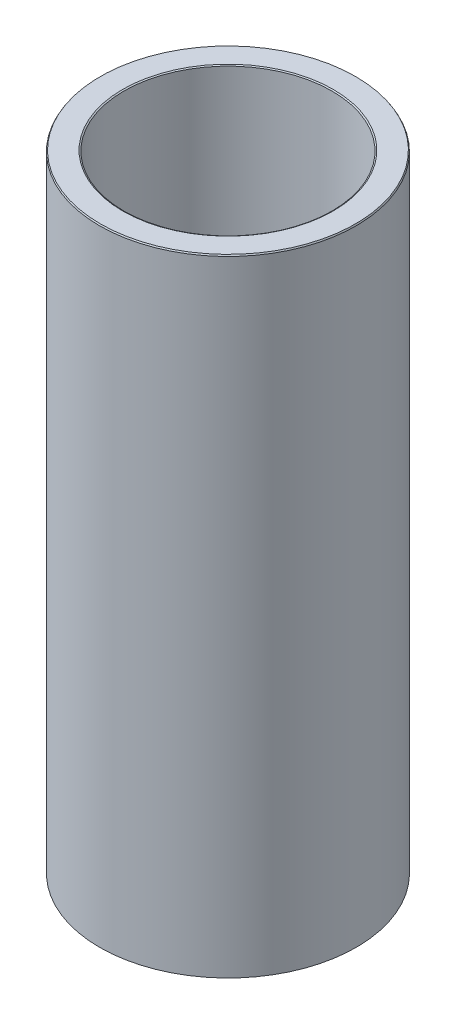
ISO-10303-21;
HEADER;
FILE_DESCRIPTION(('STEP AP214'),'2;1');
FILE_NAME('part.step','',(''),(''),'','','');
FILE_SCHEMA(('AUTOMOTIVE_DESIGN { 1 0 10303 214 1 1 1 1 }'));
ENDSEC;
DATA;
#1=APPLICATION_CONTEXT('core data for automotive mechanical design processes');
#2=APPLICATION_PROTOCOL_DEFINITION('international standard','automotive_design',2000,#1);
#3=PRODUCT_CONTEXT('',#1,'mechanical');
#4=PRODUCT('Part','Part','',(#3));
#5=PRODUCT_RELATED_PRODUCT_CATEGORY('part','',(#4));
#6=PRODUCT_DEFINITION_FORMATION('','',#4);
#7=PRODUCT_DEFINITION_CONTEXT('part definition',#1,'design');
#8=PRODUCT_DEFINITION('design','',#6,#7);
#9=PRODUCT_DEFINITION_SHAPE('','',#8);
#10=(LENGTH_UNIT() NAMED_UNIT(*) SI_UNIT(.MILLI.,.METRE.));
#11=(NAMED_UNIT(*) PLANE_ANGLE_UNIT() SI_UNIT($,.RADIAN.));
#12=(NAMED_UNIT(*) SI_UNIT($,.STERADIAN.) SOLID_ANGLE_UNIT());
#13=UNCERTAINTY_MEASURE_WITH_UNIT(LENGTH_MEASURE(1.E-05),#10,'distance_accuracy_value','');
#14=(GEOMETRIC_REPRESENTATION_CONTEXT(3) GLOBAL_UNCERTAINTY_ASSIGNED_CONTEXT((#13)) GLOBAL_UNIT_ASSIGNED_CONTEXT((#10,
#11,#12)) REPRESENTATION_CONTEXT('',''));
#15=CARTESIAN_POINT('',(0.,0.,0.));
#16=DIRECTION('',(0.,0.,1.));
#17=DIRECTION('',(1.,0.,0.));
#18=AXIS2_PLACEMENT_3D('',#15,#16,#17);
#19=CARTESIAN_POINT('',(0.,256.403338460611,0.));
#20=DIRECTION('',(0.,-1.,0.));
#21=DIRECTION('',(0.,0.,-1.));
#22=AXIS2_PLACEMENT_3D('',#19,#20,#21);
#23=CYLINDRICAL_SURFACE('',#22,52.5);
#24=CARTESIAN_POINT('',(0.,0.305078791008939,0.));
#25=DIRECTION('',(0.,1.,0.));
#26=DIRECTION('',(0.,0.,1.));
#27=AXIS2_PLACEMENT_3D('',#24,#25,#26);
#28=CIRCLE('',#27,52.5);
#29=CARTESIAN_POINT('',(0.,0.305078791008939,52.5));
#30=VERTEX_POINT('',#29);
#31=EDGE_CURVE('E10',#30,#30,#28,.T.);
#32=ORIENTED_EDGE('',*,*,#31,.T.);
#33=EDGE_LOOP('',(#32));
#34=FACE_BOUND('',#33,.T.);
#35=CARTESIAN_POINT('',(0.,255.874926494271,0.));
#36=DIRECTION('',(0.,1.,0.));
#37=DIRECTION('',(0.,0.,1.));
#38=AXIS2_PLACEMENT_3D('',#35,#36,#37);
#39=CIRCLE('',#38,52.5);
#40=CARTESIAN_POINT('',(0.,255.874926494271,52.5));
#41=VERTEX_POINT('',#40);
#42=EDGE_CURVE('E50',#41,#41,#39,.F.);
#43=ORIENTED_EDGE('',*,*,#42,.T.);
#44=EDGE_LOOP('',(#43));
#45=FACE_BOUND('',#44,.T.);
#46=ADVANCED_FACE('F39',(#34,#45),#23,.T.);
#47=CARTESIAN_POINT('',(0.,256.403338460611,0.));
#48=DIRECTION('',(0.,1.,0.));
#49=DIRECTION('',(0.,0.,1.));
#50=AXIS2_PLACEMENT_3D('',#47,#48,#49);
#51=PLANE('',#50);
#52=CARTESIAN_POINT('',(0.,256.403338460611,0.));
#53=DIRECTION('',(0.,1.,0.));
#54=DIRECTION('',(0.,0.,1.));
#55=AXIS2_PLACEMENT_3D('',#52,#53,#54);
#56=CIRCLE('',#55,43.0699369055834);
#57=CARTESIAN_POINT('',(0.,256.403338460611,43.0699369055834));
#58=VERTEX_POINT('',#57);
#59=EDGE_CURVE('E58',#58,#58,#56,.F.);
#60=ORIENTED_EDGE('',*,*,#59,.T.);
#61=EDGE_LOOP('',(#60));
#62=FACE_BOUND('',#61,.T.);
#63=CARTESIAN_POINT('',(0.,256.403338460611,0.));
#64=DIRECTION('',(0.,1.,0.));
#65=DIRECTION('',(0.,0.,1.));
#66=AXIS2_PLACEMENT_3D('',#63,#64,#65);
#67=CIRCLE('',#66,52.194921208991);
#68=CARTESIAN_POINT('',(0.,256.403338460611,52.194921208991));
#69=VERTEX_POINT('',#68);
#70=EDGE_CURVE('E61',#69,#69,#67,.T.);
#71=ORIENTED_EDGE('',*,*,#70,.T.);
#72=EDGE_LOOP('',(#71));
#73=FACE_BOUND('',#72,.T.);
#74=ADVANCED_FACE('F88',(#62,#73),#51,.T.);
#75=CARTESIAN_POINT('',(0.,0.,0.));
#76=DIRECTION('',(0.,1.,0.));
#77=DIRECTION('',(0.,0.,1.));
#78=AXIS2_PLACEMENT_3D('',#75,#76,#77);
#79=PLANE('',#78);
#80=CARTESIAN_POINT('',(0.,0.,0.));
#81=DIRECTION('',(0.,1.,0.));
#82=DIRECTION('',(0.,0.,1.));
#83=AXIS2_PLACEMENT_3D('',#80,#81,#82);
#84=CIRCLE('',#83,42.8466037302532);
#85=CARTESIAN_POINT('',(0.,0.,42.8466037302532));
#86=VERTEX_POINT('',#85);
#87=EDGE_CURVE('E51',#86,#86,#84,.T.);
#88=ORIENTED_EDGE('',*,*,#87,.T.);
#89=EDGE_LOOP('',(#88));
#90=FACE_BOUND('',#89,.T.);
#91=CARTESIAN_POINT('',(0.,0.,0.));
#92=DIRECTION('',(0.,1.,0.));
#93=DIRECTION('',(0.,0.,1.));
#94=AXIS2_PLACEMENT_3D('',#91,#92,#93);
#95=CIRCLE('',#94,51.9715880336608);
#96=CARTESIAN_POINT('',(0.,0.,51.9715880336608));
#97=VERTEX_POINT('',#96);
#98=EDGE_CURVE('E54',#97,#97,#95,.F.);
#99=ORIENTED_EDGE('',*,*,#98,.T.);
#100=EDGE_LOOP('',(#99));
#101=FACE_BOUND('',#100,.T.);
#102=ADVANCED_FACE('F83',(#90,#101),#79,.F.);
#103=CARTESIAN_POINT('',(0.,256.403338460611,0.));
#104=DIRECTION('',(0.,-1.,0.));
#105=DIRECTION('',(0.,0.,-1.));
#106=AXIS2_PLACEMENT_3D('',#103,#104,#105);
#107=CYLINDRICAL_SURFACE('',#106,42.5415249392442);
#108=CARTESIAN_POINT('',(0.,256.098259669602,0.));
#109=DIRECTION('',(0.,1.,0.));
#110=DIRECTION('',(0.,0.,1.));
#111=AXIS2_PLACEMENT_3D('',#108,#109,#110);
#112=CIRCLE('',#111,42.5415249392442);
#113=CARTESIAN_POINT('',(0.,256.098259669602,42.5415249392442));
#114=VERTEX_POINT('',#113);
#115=EDGE_CURVE('E67',#114,#114,#112,.T.);
#116=ORIENTED_EDGE('',*,*,#115,.T.);
#117=EDGE_LOOP('',(#116));
#118=FACE_BOUND('',#117,.T.);
#119=CARTESIAN_POINT('',(0.,0.528411966339293,0.));
#120=DIRECTION('',(0.,1.,0.));
#121=DIRECTION('',(0.,0.,1.));
#122=AXIS2_PLACEMENT_3D('',#119,#120,#121);
#123=CIRCLE('',#122,42.5415249392442);
#124=CARTESIAN_POINT('',(0.,0.528411966339293,42.5415249392442));
#125=VERTEX_POINT('',#124);
#126=EDGE_CURVE('E69',#125,#125,#123,.F.);
#127=ORIENTED_EDGE('',*,*,#126,.T.);
#128=EDGE_LOOP('',(#127));
#129=FACE_BOUND('',#128,.T.);
#130=ADVANCED_FACE('F71',(#118,#129),#107,.F.);
#131=CARTESIAN_POINT('',(0.,256.098259669602,0.));
#132=DIRECTION('',(0.,1.,0.));
#133=DIRECTION('',(0.,0.,1.));
#134=AXIS2_PLACEMENT_3D('',#131,#132,#133);
#135=CONICAL_SURFACE('',#134,42.5415249392442,1.04719755119653);
#136=ORIENTED_EDGE('',*,*,#59,.F.);
#137=EDGE_LOOP('',(#136));
#138=FACE_BOUND('',#137,.T.);
#139=ORIENTED_EDGE('',*,*,#115,.F.);
#140=EDGE_LOOP('',(#139));
#141=FACE_BOUND('',#140,.T.);
#142=ADVANCED_FACE('F77',(#138,#141),#135,.F.);
#143=CARTESIAN_POINT('',(0.,0.,0.));
#144=DIRECTION('',(0.,-1.,0.));
#145=DIRECTION('',(0.,0.,-1.));
#146=AXIS2_PLACEMENT_3D('',#143,#144,#145);
#147=CONICAL_SURFACE('',#146,42.8466037302532,0.523598775598287);
#148=ORIENTED_EDGE('',*,*,#126,.F.);
#149=EDGE_LOOP('',(#148));
#150=FACE_BOUND('',#149,.T.);
#151=ORIENTED_EDGE('',*,*,#87,.F.);
#152=EDGE_LOOP('',(#151));
#153=FACE_BOUND('',#152,.T.);
#154=ADVANCED_FACE('F73',(#150,#153),#147,.F.);
#155=CARTESIAN_POINT('',(0.,0.305078791008939,0.));
#156=DIRECTION('',(0.,1.,0.));
#157=DIRECTION('',(0.,0.,1.));
#158=AXIS2_PLACEMENT_3D('',#155,#156,#157);
#159=CONICAL_SURFACE('',#158,52.5,1.04719755119664);
#160=ORIENTED_EDGE('',*,*,#98,.F.);
#161=EDGE_LOOP('',(#160));
#162=FACE_BOUND('',#161,.T.);
#163=ORIENTED_EDGE('',*,*,#31,.F.);
#164=EDGE_LOOP('',(#163));
#165=FACE_BOUND('',#164,.T.);
#166=ADVANCED_FACE('F76',(#162,#165),#159,.T.);
#167=CARTESIAN_POINT('',(0.,256.403338460611,0.));
#168=DIRECTION('',(0.,-1.,0.));
#169=DIRECTION('',(0.,0.,-1.));
#170=AXIS2_PLACEMENT_3D('',#167,#168,#169);
#171=CONICAL_SURFACE('',#170,52.194921208991,0.523598775598281);
#172=ORIENTED_EDGE('',*,*,#42,.F.);
#173=EDGE_LOOP('',(#172));
#174=FACE_BOUND('',#173,.T.);
#175=ORIENTED_EDGE('',*,*,#70,.F.);
#176=EDGE_LOOP('',(#175));
#177=FACE_BOUND('',#176,.T.);
#178=ADVANCED_FACE('F45',(#174,#177),#171,.T.);
#179=CLOSED_SHELL('',(#46,#74,#102,#130,#142,#154,#166,#178));
#180=MANIFOLD_SOLID_BREP('B2',#179);
#181=ADVANCED_BREP_SHAPE_REPRESENTATION('',(#18,#180),#14);
#182=SHAPE_DEFINITION_REPRESENTATION(#9,#181);
ENDSEC;
END-ISO-10303-21;
